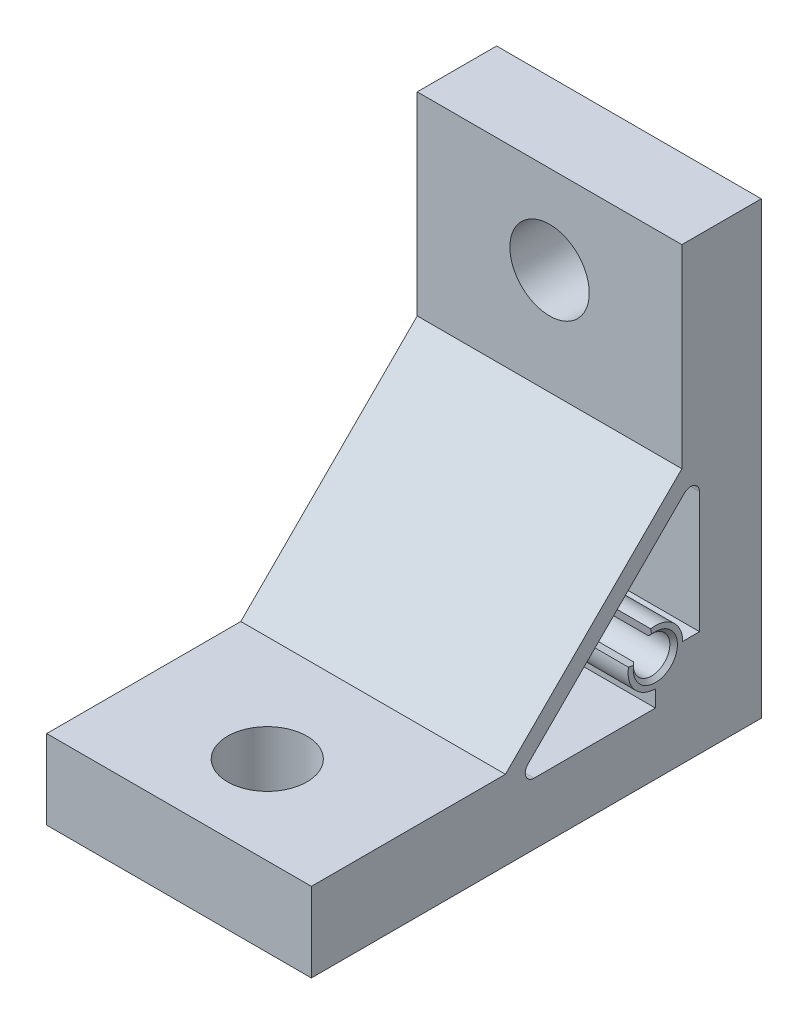
ISO-10303-21;
HEADER;
FILE_DESCRIPTION(('STEP AP214'),'2;1');
FILE_NAME('part.step','',(''),(''),'','','');
FILE_SCHEMA(('AUTOMOTIVE_DESIGN { 1 0 10303 214 1 1 1 1 }'));
ENDSEC;
DATA;
#1=APPLICATION_CONTEXT('core data for automotive mechanical design processes');
#2=APPLICATION_PROTOCOL_DEFINITION('international standard','automotive_design',2000,#1);
#3=PRODUCT_CONTEXT('',#1,'mechanical');
#4=PRODUCT('Part','Part','',(#3));
#5=PRODUCT_RELATED_PRODUCT_CATEGORY('part','',(#4));
#6=PRODUCT_DEFINITION_FORMATION('','',#4);
#7=PRODUCT_DEFINITION_CONTEXT('part definition',#1,'design');
#8=PRODUCT_DEFINITION('design','',#6,#7);
#9=PRODUCT_DEFINITION_SHAPE('','',#8);
#10=(LENGTH_UNIT() NAMED_UNIT(*) SI_UNIT(.MILLI.,.METRE.));
#11=(NAMED_UNIT(*) PLANE_ANGLE_UNIT() SI_UNIT($,.RADIAN.));
#12=(NAMED_UNIT(*) SI_UNIT($,.STERADIAN.) SOLID_ANGLE_UNIT());
#13=UNCERTAINTY_MEASURE_WITH_UNIT(LENGTH_MEASURE(1.E-05),#10,'distance_accuracy_value','');
#14=(GEOMETRIC_REPRESENTATION_CONTEXT(3) GLOBAL_UNCERTAINTY_ASSIGNED_CONTEXT((#13)) GLOBAL_UNIT_ASSIGNED_CONTEXT((#10,
#11,#12)) REPRESENTATION_CONTEXT('',''));
#15=CARTESIAN_POINT('',(0.,0.,0.));
#16=DIRECTION('',(0.,0.,1.));
#17=DIRECTION('',(1.,0.,0.));
#18=AXIS2_PLACEMENT_3D('',#15,#16,#17);
#19=CARTESIAN_POINT('',(15.,12.5842575299601,12.5842575299601));
#20=DIRECTION('',(-1.,0.,0.));
#21=DIRECTION('',(0.,0.,1.));
#22=AXIS2_PLACEMENT_3D('',#19,#20,#21);
#23=CYLINDRICAL_SURFACE('',#22,1.5);
#24=DIRECTION('',(-1.,0.,0.));
#25=VECTOR('',#24,1.);
#26=CARTESIAN_POINT('',(15.,12.3646611731006,14.0680962813256));
#27=LINE('',#26,#25);
#28=CARTESIAN_POINT('',(14.6000000000132,12.3646611731006,14.0680962813256));
#29=VERTEX_POINT('',#28);
#30=CARTESIAN_POINT('',(-15.,12.3646611731006,14.0680962813256));
#31=VERTEX_POINT('',#30);
#32=EDGE_CURVE('E231',#29,#31,#27,.T.);
#33=ORIENTED_EDGE('',*,*,#32,.F.);
#34=CARTESIAN_POINT('',(14.6000000000132,12.3646611731006,14.0680962813256));
#35=CARTESIAN_POINT('',(14.5946552278805,12.3479248156858,14.065617542445));
#36=CARTESIAN_POINT('',(14.5892328408037,12.3312644465256,14.0628636826782));
#37=CARTESIAN_POINT('',(14.5782328406928,12.2980956965681,14.0568057235374));
#38=CARTESIAN_POINT('',(14.5726552277696,12.281587315662,14.0535016245565));
#39=CARTESIAN_POINT('',(14.5670000000132,12.265154922902,14.0499224050829));
#40=B_SPLINE_CURVE_WITH_KNOTS('',3,(#34,#35,#36,#37,#38,#39),.UNSPECIFIED.,.F.,.F.,(4,2,4),(0.,
0.0532070045388904,0.10641397104909),.UNSPECIFIED.);
#41=CARTESIAN_POINT('',(14.5670000000132,12.265154922902,14.0499224050829));
#42=VERTEX_POINT('',#41);
#43=EDGE_CURVE('E11',#29,#42,#40,.T.);
#44=ORIENTED_EDGE('',*,*,#43,.T.);
#45=DIRECTION('',(1.,0.,0.));
#46=VECTOR('',#45,1.);
#47=CARTESIAN_POINT('',(0.,12.265154922902,14.0499224050829));
#48=LINE('',#47,#46);
#49=CARTESIAN_POINT('',(-15.,12.265154922902,14.0499224050829));
#50=VERTEX_POINT('',#49);
#51=EDGE_CURVE('E200',#42,#50,#48,.F.);
#52=ORIENTED_EDGE('',*,*,#51,.T.);
#53=CARTESIAN_POINT('',(-15.,12.5842575299601,12.5842575299601));
#54=DIRECTION('',(-1.,0.,0.));
#55=DIRECTION('',(0.,0.,1.));
#56=AXIS2_PLACEMENT_3D('',#53,#54,#55);
#57=CIRCLE('',#56,1.5);
#58=EDGE_CURVE('E211',#50,#31,#57,.T.);
#59=ORIENTED_EDGE('',*,*,#58,.T.);
#60=EDGE_LOOP('',(#33,#44,#52,#59));
#61=FACE_BOUND('',#60,.T.);
#62=ADVANCED_FACE('F35',(#61),#23,.F.);
#63=CARTESIAN_POINT('',(-15.,0.,0.));
#64=DIRECTION('',(0.,0.,-1.));
#65=DIRECTION('',(-1.,0.,0.));
#66=AXIS2_PLACEMENT_3D('',#63,#64,#65);
#67=PLANE('',#66);
#68=CARTESIAN_POINT('',(0.,41.,0.));
#69=DIRECTION('',(0.,0.,1.));
#70=DIRECTION('',(1.,0.,0.));
#71=AXIS2_PLACEMENT_3D('',#68,#69,#70);
#72=CIRCLE('',#71,4.49999999999999);
#73=CARTESIAN_POINT('',(4.49999999999999,41.,0.));
#74=VERTEX_POINT('',#73);
#75=EDGE_CURVE('E213',#74,#74,#72,.T.);
#76=ORIENTED_EDGE('',*,*,#75,.T.);
#77=EDGE_LOOP('',(#76));
#78=FACE_BOUND('',#77,.T.);
#79=DIRECTION('',(0.,1.,0.));
#80=VECTOR('',#79,1.);
#81=CARTESIAN_POINT('',(15.,0.,0.));
#82=LINE('',#81,#80);
#83=CARTESIAN_POINT('',(15.,0.,0.));
#84=VERTEX_POINT('',#83);
#85=CARTESIAN_POINT('',(15.,51.,0.));
#86=VERTEX_POINT('',#85);
#87=EDGE_CURVE('E274',#84,#86,#82,.T.);
#88=ORIENTED_EDGE('',*,*,#87,.F.);
#89=DIRECTION('',(1.,0.,0.));
#90=VECTOR('',#89,1.);
#91=CARTESIAN_POINT('',(-15.,0.,0.));
#92=LINE('',#91,#90);
#93=CARTESIAN_POINT('',(-15.,0.,0.));
#94=VERTEX_POINT('',#93);
#95=EDGE_CURVE('E201',#94,#84,#92,.T.);
#96=ORIENTED_EDGE('',*,*,#95,.F.);
#97=DIRECTION('',(0.,1.,0.));
#98=VECTOR('',#97,1.);
#99=CARTESIAN_POINT('',(-15.,0.,0.));
#100=LINE('',#99,#98);
#101=CARTESIAN_POINT('',(-15.,51.,0.));
#102=VERTEX_POINT('',#101);
#103=EDGE_CURVE('E280',#94,#102,#100,.T.);
#104=ORIENTED_EDGE('',*,*,#103,.T.);
#105=DIRECTION('',(1.,0.,0.));
#106=VECTOR('',#105,1.);
#107=CARTESIAN_POINT('',(-15.,51.,0.));
#108=LINE('',#107,#106);
#109=EDGE_CURVE('E292',#102,#86,#108,.T.);
#110=ORIENTED_EDGE('',*,*,#109,.T.);
#111=EDGE_LOOP('',(#88,#96,#104,#110));
#112=FACE_BOUND('',#111,.T.);
#113=ADVANCED_FACE('F390',(#78,#112),#67,.T.);
#114=CARTESIAN_POINT('',(-15.,0.,51.));
#115=DIRECTION('',(0.,-1.,0.));
#116=DIRECTION('',(0.,0.,-1.));
#117=AXIS2_PLACEMENT_3D('',#114,#115,#116);
#118=PLANE('',#117);
#119=CARTESIAN_POINT('',(0.,0.,41.));
#120=DIRECTION('',(0.,1.,0.));
#121=DIRECTION('',(0.,0.,1.));
#122=AXIS2_PLACEMENT_3D('',#119,#120,#121);
#123=CIRCLE('',#122,4.49999999999998);
#124=CARTESIAN_POINT('',(0.,0.,45.5));
#125=VERTEX_POINT('',#124);
#126=EDGE_CURVE('E439',#125,#125,#123,.T.);
#127=ORIENTED_EDGE('',*,*,#126,.T.);
#128=EDGE_LOOP('',(#127));
#129=FACE_BOUND('',#128,.T.);
#130=DIRECTION('',(0.,0.,-1.));
#131=VECTOR('',#130,1.);
#132=CARTESIAN_POINT('',(15.,0.,51.));
#133=LINE('',#132,#131);
#134=CARTESIAN_POINT('',(15.,0.,51.));
#135=VERTEX_POINT('',#134);
#136=EDGE_CURVE('E284',#135,#84,#133,.T.);
#137=ORIENTED_EDGE('',*,*,#136,.F.);
#138=DIRECTION('',(1.,0.,0.));
#139=VECTOR('',#138,1.);
#140=CARTESIAN_POINT('',(-15.,0.,51.));
#141=LINE('',#140,#139);
#142=CARTESIAN_POINT('',(-15.,0.,51.));
#143=VERTEX_POINT('',#142);
#144=EDGE_CURVE('E303',#143,#135,#141,.T.);
#145=ORIENTED_EDGE('',*,*,#144,.F.);
#146=DIRECTION('',(0.,0.,-1.));
#147=VECTOR('',#146,1.);
#148=CARTESIAN_POINT('',(-15.,0.,51.));
#149=LINE('',#148,#147);
#150=EDGE_CURVE('E289',#143,#94,#149,.T.);
#151=ORIENTED_EDGE('',*,*,#150,.T.);
#152=ORIENTED_EDGE('',*,*,#95,.T.);
#153=EDGE_LOOP('',(#137,#145,#151,#152));
#154=FACE_BOUND('',#153,.T.);
#155=ADVANCED_FACE('F386',(#129,#154),#118,.T.);
#156=CARTESIAN_POINT('',(-15.,51.,51.));
#157=DIRECTION('',(0.,0.,1.));
#158=DIRECTION('',(1.,0.,0.));
#159=AXIS2_PLACEMENT_3D('',#156,#157,#158);
#160=PLANE('',#159);
#161=DIRECTION('',(-1.,0.,0.));
#162=VECTOR('',#161,1.);
#163=CARTESIAN_POINT('',(15.,9.,51.));
#164=LINE('',#163,#162);
#165=CARTESIAN_POINT('',(15.,9.,51.));
#166=VERTEX_POINT('',#165);
#167=CARTESIAN_POINT('',(-15.,9.,51.));
#168=VERTEX_POINT('',#167);
#169=EDGE_CURVE('E271',#166,#168,#164,.T.);
#170=ORIENTED_EDGE('',*,*,#169,.T.);
#171=DIRECTION('',(0.,-1.,0.));
#172=VECTOR('',#171,1.);
#173=CARTESIAN_POINT('',(-15.,51.,51.));
#174=LINE('',#173,#172);
#175=EDGE_CURVE('E287',#168,#143,#174,.T.);
#176=ORIENTED_EDGE('',*,*,#175,.T.);
#177=ORIENTED_EDGE('',*,*,#144,.T.);
#178=DIRECTION('',(0.,-1.,0.));
#179=VECTOR('',#178,1.);
#180=CARTESIAN_POINT('',(15.,51.,51.));
#181=LINE('',#180,#179);
#182=EDGE_CURVE('E298',#166,#135,#181,.T.);
#183=ORIENTED_EDGE('',*,*,#182,.F.);
#184=EDGE_LOOP('',(#170,#176,#177,#183));
#185=FACE_BOUND('',#184,.T.);
#186=ADVANCED_FACE('F389',(#185),#160,.T.);
#187=CARTESIAN_POINT('',(-15.,51.,0.));
#188=DIRECTION('',(0.,1.,0.));
#189=DIRECTION('',(0.,0.,1.));
#190=AXIS2_PLACEMENT_3D('',#187,#188,#189);
#191=PLANE('',#190);
#192=DIRECTION('',(-1.,0.,0.));
#193=VECTOR('',#192,1.);
#194=CARTESIAN_POINT('',(15.,51.,9.));
#195=LINE('',#194,#193);
#196=CARTESIAN_POINT('',(15.,51.,9.));
#197=VERTEX_POINT('',#196);
#198=CARTESIAN_POINT('',(-15.,51.,9.));
#199=VERTEX_POINT('',#198);
#200=EDGE_CURVE('E264',#197,#199,#195,.T.);
#201=ORIENTED_EDGE('',*,*,#200,.F.);
#202=DIRECTION('',(0.,0.,1.));
#203=VECTOR('',#202,1.);
#204=CARTESIAN_POINT('',(15.,51.,0.));
#205=LINE('',#204,#203);
#206=EDGE_CURVE('E295',#86,#197,#205,.T.);
#207=ORIENTED_EDGE('',*,*,#206,.F.);
#208=ORIENTED_EDGE('',*,*,#109,.F.);
#209=DIRECTION('',(0.,0.,1.));
#210=VECTOR('',#209,1.);
#211=CARTESIAN_POINT('',(-15.,51.,0.));
#212=LINE('',#211,#210);
#213=EDGE_CURVE('E283',#102,#199,#212,.T.);
#214=ORIENTED_EDGE('',*,*,#213,.T.);
#215=EDGE_LOOP('',(#201,#207,#208,#214));
#216=FACE_BOUND('',#215,.T.);
#217=ADVANCED_FACE('F382',(#216),#191,.T.);
#218=CARTESIAN_POINT('',(-15.,0.,0.));
#219=DIRECTION('',(1.,0.,0.));
#220=DIRECTION('',(0.,0.,-1.));
#221=AXIS2_PLACEMENT_3D('',#218,#219,#220);
#222=PLANE('',#221);
#223=ORIENTED_EDGE('',*,*,#58,.F.);
#224=CARTESIAN_POINT('',(-15.,12.,12.));
#225=DIRECTION('',(1.,0.,0.));
#226=DIRECTION('',(0.,0.,-1.));
#227=AXIS2_PLACEMENT_3D('',#224,#225,#226);
#228=CIRCLE('',#227,2.067);
#229=CARTESIAN_POINT('',(-15.,14.0499224050829,12.265154922902));
#230=VERTEX_POINT('',#229);
#231=EDGE_CURVE('E193',#50,#230,#228,.T.);
#232=ORIENTED_EDGE('',*,*,#231,.T.);
#233=CARTESIAN_POINT('',(-15.,14.0680962813256,12.3646611731006));
#234=VERTEX_POINT('',#233);
#235=EDGE_CURVE('E208',#234,#230,#57,.T.);
#236=ORIENTED_EDGE('',*,*,#235,.F.);
#237=DIRECTION('',(0.,-0.98480775301221,-0.173648177666919));
#238=VECTOR('',#237,1.);
#239=CARTESIAN_POINT('',(-15.,15.0529040343378,12.5383093507675));
#240=LINE('',#239,#238);
#241=CARTESIAN_POINT('',(-15.,15.0529040343378,12.5383093507675));
#242=VERTEX_POINT('',#241);
#243=EDGE_CURVE('E224',#242,#234,#240,.T.);
#244=ORIENTED_EDGE('',*,*,#243,.F.);
#245=CARTESIAN_POINT('',(-15.,12.,12.));
#246=DIRECTION('',(1.,0.,0.));
#247=DIRECTION('',(0.,0.,-1.));
#248=AXIS2_PLACEMENT_3D('',#245,#246,#247);
#249=CIRCLE('',#248,3.1);
#250=CARTESIAN_POINT('',(-15.,12.,8.9));
#251=VERTEX_POINT('',#250);
#252=EDGE_CURVE('E498',#251,#242,#249,.T.);
#253=ORIENTED_EDGE('',*,*,#252,.F.);
#254=DIRECTION('',(0.,0.,1.));
#255=VECTOR('',#254,1.);
#256=CARTESIAN_POINT('',(-15.,12.,7.));
#257=LINE('',#256,#255);
#258=CARTESIAN_POINT('',(-15.,12.,7.));
#259=VERTEX_POINT('',#258);
#260=EDGE_CURVE('E496',#259,#251,#257,.T.);
#261=ORIENTED_EDGE('',*,*,#260,.F.);
#262=DIRECTION('',(0.,-1.,0.));
#263=VECTOR('',#262,1.);
#264=CARTESIAN_POINT('',(-15.,25.7573593128807,7.));
#265=LINE('',#264,#263);
#266=CARTESIAN_POINT('',(-15.,25.7573593128807,7.));
#267=VERTEX_POINT('',#266);
#268=EDGE_CURVE('E493',#267,#259,#265,.T.);
#269=ORIENTED_EDGE('',*,*,#268,.F.);
#270=CARTESIAN_POINT('',(-15.,25.7573593128807,8.));
#271=DIRECTION('',(-1.,0.,0.));
#272=DIRECTION('',(0.,0.,1.));
#273=AXIS2_PLACEMENT_3D('',#270,#271,#272);
#274=CIRCLE('',#273,1.00000000000001);
#275=CARTESIAN_POINT('',(-15.,26.4644660940673,8.70710678118654));
#276=VERTEX_POINT('',#275);
#277=EDGE_CURVE('E490',#276,#267,#274,.T.);
#278=ORIENTED_EDGE('',*,*,#277,.F.);
#279=DIRECTION('',(0.,0.707106781186547,-0.707106781186548));
#280=VECTOR('',#279,1.);
#281=CARTESIAN_POINT('',(-15.,8.70710678118656,26.4644660940673));
#282=LINE('',#281,#280);
#283=CARTESIAN_POINT('',(-15.,8.70710678118656,26.4644660940673));
#284=VERTEX_POINT('',#283);
#285=EDGE_CURVE('E487',#284,#276,#282,.T.);
#286=ORIENTED_EDGE('',*,*,#285,.F.);
#287=CARTESIAN_POINT('',(-15.,8.,25.7573593128807));
#288=DIRECTION('',(-1.,0.,0.));
#289=DIRECTION('',(0.,0.,1.));
#290=AXIS2_PLACEMENT_3D('',#287,#288,#289);
#291=CIRCLE('',#290,1.00000000000002);
#292=CARTESIAN_POINT('',(-15.,6.99999999999998,25.7573593128807));
#293=VERTEX_POINT('',#292);
#294=EDGE_CURVE('E484',#293,#284,#291,.T.);
#295=ORIENTED_EDGE('',*,*,#294,.F.);
#296=DIRECTION('',(0.,0.,1.));
#297=VECTOR('',#296,1.);
#298=CARTESIAN_POINT('',(-15.,7.,12.));
#299=LINE('',#298,#297);
#300=CARTESIAN_POINT('',(-15.,7.,12.));
#301=VERTEX_POINT('',#300);
#302=EDGE_CURVE('E481',#301,#293,#299,.T.);
#303=ORIENTED_EDGE('',*,*,#302,.F.);
#304=DIRECTION('',(0.,-1.,0.));
#305=VECTOR('',#304,1.);
#306=CARTESIAN_POINT('',(-15.,8.9,12.));
#307=LINE('',#306,#305);
#308=CARTESIAN_POINT('',(-15.,8.9,12.));
#309=VERTEX_POINT('',#308);
#310=EDGE_CURVE('E478',#309,#301,#307,.T.);
#311=ORIENTED_EDGE('',*,*,#310,.F.);
#312=CARTESIAN_POINT('',(-15.,12.,12.));
#313=DIRECTION('',(1.,0.,0.));
#314=DIRECTION('',(0.,0.,-1.));
#315=AXIS2_PLACEMENT_3D('',#312,#313,#314);
#316=CIRCLE('',#315,3.1);
#317=CARTESIAN_POINT('',(-15.,12.5383093507675,15.0529040343378));
#318=VERTEX_POINT('',#317);
#319=EDGE_CURVE('E212',#318,#309,#316,.T.);
#320=ORIENTED_EDGE('',*,*,#319,.F.);
#321=DIRECTION('',(0.,0.173648177666932,0.984807753012208));
#322=VECTOR('',#321,1.);
#323=CARTESIAN_POINT('',(-15.,12.3646611731006,14.0680962813256));
#324=LINE('',#323,#322);
#325=EDGE_CURVE('E219',#31,#318,#324,.T.);
#326=ORIENTED_EDGE('',*,*,#325,.F.);
#327=EDGE_LOOP('',(#223,#232,#236,#244,#253,#261,#269,#278,#286,#295,#303,#311,#320,#326));
#328=FACE_BOUND('',#327,.T.);
#329=ORIENTED_EDGE('',*,*,#175,.F.);
#330=DIRECTION('',(0.,0.,1.));
#331=VECTOR('',#330,1.);
#332=CARTESIAN_POINT('',(-15.,9.,29.));
#333=LINE('',#332,#331);
#334=CARTESIAN_POINT('',(-15.,9.,29.));
#335=VERTEX_POINT('',#334);
#336=EDGE_CURVE('E258',#335,#168,#333,.T.);
#337=ORIENTED_EDGE('',*,*,#336,.F.);
#338=DIRECTION('',(0.,-0.707106781186547,0.707106781186548));
#339=VECTOR('',#338,1.);
#340=CARTESIAN_POINT('',(-15.,29.,9.));
#341=LINE('',#340,#339);
#342=CARTESIAN_POINT('',(-15.,29.,9.));
#343=VERTEX_POINT('',#342);
#344=EDGE_CURVE('E267',#343,#335,#341,.T.);
#345=ORIENTED_EDGE('',*,*,#344,.F.);
#346=DIRECTION('',(0.,-1.,0.));
#347=VECTOR('',#346,1.);
#348=CARTESIAN_POINT('',(-15.,51.,9.));
#349=LINE('',#348,#347);
#350=EDGE_CURVE('E230',#199,#343,#349,.T.);
#351=ORIENTED_EDGE('',*,*,#350,.F.);
#352=ORIENTED_EDGE('',*,*,#213,.F.);
#353=ORIENTED_EDGE('',*,*,#103,.F.);
#354=ORIENTED_EDGE('',*,*,#150,.F.);
#355=EDGE_LOOP('',(#329,#337,#345,#351,#352,#353,#354));
#356=FACE_BOUND('',#355,.T.);
#357=ADVANCED_FACE('F205',(#328,#356),#222,.F.);
#358=CARTESIAN_POINT('',(15.,0.,0.));
#359=DIRECTION('',(1.,0.,0.));
#360=DIRECTION('',(0.,0.,-1.));
#361=AXIS2_PLACEMENT_3D('',#358,#359,#360);
#362=PLANE('',#361);
#363=DIRECTION('',(0.,-0.98480775301221,-0.173648177666919));
#364=VECTOR('',#363,1.);
#365=CARTESIAN_POINT('',(15.,15.0529040343378,12.5383093507675));
#366=LINE('',#365,#364);
#367=CARTESIAN_POINT('',(15.,15.0529040343378,12.5383093507675));
#368=VERTEX_POINT('',#367);
#369=CARTESIAN_POINT('',(15.,14.5120855163498,12.4429484543795));
#370=VERTEX_POINT('',#369);
#371=EDGE_CURVE('E473',#368,#370,#366,.T.);
#372=ORIENTED_EDGE('',*,*,#371,.T.);
#373=CARTESIAN_POINT('',(15.,12.5842575299601,12.5842575299601));
#374=DIRECTION('',(1.,0.,0.));
#375=DIRECTION('',(0.,0.,-1.));
#376=AXIS2_PLACEMENT_3D('',#373,#374,#375);
#377=CIRCLE('',#376,1.93299999998681);
#378=CARTESIAN_POINT('',(15.,14.4877109599947,12.2475766133066));
#379=VERTEX_POINT('',#378);
#380=EDGE_CURVE('E310',#370,#379,#377,.F.);
#381=ORIENTED_EDGE('',*,*,#380,.T.);
#382=CARTESIAN_POINT('',(15.,12.,12.));
#383=DIRECTION('',(1.,0.,0.));
#384=DIRECTION('',(0.,0.,-1.));
#385=AXIS2_PLACEMENT_3D('',#382,#383,#384);
#386=CIRCLE('',#385,2.49999999998681);
#387=CARTESIAN_POINT('',(15.,12.4341204441651,14.4620193825175));
#388=VERTEX_POINT('',#387);
#389=EDGE_CURVE('E308',#379,#388,#386,.F.);
#390=ORIENTED_EDGE('',*,*,#389,.T.);
#391=DIRECTION('',(0.,0.173648177666932,0.984807753012208));
#392=VECTOR('',#391,1.);
#393=CARTESIAN_POINT('',(15.,12.3646611731006,14.0680962813256));
#394=LINE('',#393,#392);
#395=CARTESIAN_POINT('',(15.,12.5383093507675,15.0529040343378));
#396=VERTEX_POINT('',#395);
#397=EDGE_CURVE('E253',#388,#396,#394,.T.);
#398=ORIENTED_EDGE('',*,*,#397,.T.);
#399=CARTESIAN_POINT('',(15.,12.,12.));
#400=DIRECTION('',(1.,0.,0.));
#401=DIRECTION('',(0.,0.,-1.));
#402=AXIS2_PLACEMENT_3D('',#399,#400,#401);
#403=CIRCLE('',#402,3.1);
#404=CARTESIAN_POINT('',(15.,8.9,12.));
#405=VERTEX_POINT('',#404);
#406=EDGE_CURVE('E222',#396,#405,#403,.T.);
#407=ORIENTED_EDGE('',*,*,#406,.T.);
#408=DIRECTION('',(0.,-1.,0.));
#409=VECTOR('',#408,1.);
#410=CARTESIAN_POINT('',(15.,8.9,12.));
#411=LINE('',#410,#409);
#412=CARTESIAN_POINT('',(15.,7.,12.));
#413=VERTEX_POINT('',#412);
#414=EDGE_CURVE('E449',#405,#413,#411,.T.);
#415=ORIENTED_EDGE('',*,*,#414,.T.);
#416=DIRECTION('',(0.,0.,1.));
#417=VECTOR('',#416,1.);
#418=CARTESIAN_POINT('',(15.,7.,12.));
#419=LINE('',#418,#417);
#420=CARTESIAN_POINT('',(15.,6.99999999999998,25.7573593128807));
#421=VERTEX_POINT('',#420);
#422=EDGE_CURVE('E452',#413,#421,#419,.T.);
#423=ORIENTED_EDGE('',*,*,#422,.T.);
#424=CARTESIAN_POINT('',(15.,8.,25.7573593128807));
#425=DIRECTION('',(-1.,0.,0.));
#426=DIRECTION('',(0.,0.,1.));
#427=AXIS2_PLACEMENT_3D('',#424,#425,#426);
#428=CIRCLE('',#427,1.00000000000002);
#429=CARTESIAN_POINT('',(15.,8.70710678118656,26.4644660940673));
#430=VERTEX_POINT('',#429);
#431=EDGE_CURVE('E455',#421,#430,#428,.T.);
#432=ORIENTED_EDGE('',*,*,#431,.T.);
#433=DIRECTION('',(0.,0.707106781186547,-0.707106781186548));
#434=VECTOR('',#433,1.);
#435=CARTESIAN_POINT('',(15.,8.70710678118656,26.4644660940673));
#436=LINE('',#435,#434);
#437=CARTESIAN_POINT('',(15.,26.4644660940673,8.70710678118654));
#438=VERTEX_POINT('',#437);
#439=EDGE_CURVE('E458',#430,#438,#436,.T.);
#440=ORIENTED_EDGE('',*,*,#439,.T.);
#441=CARTESIAN_POINT('',(15.,25.7573593128807,8.));
#442=DIRECTION('',(-1.,0.,0.));
#443=DIRECTION('',(0.,0.,1.));
#444=AXIS2_PLACEMENT_3D('',#441,#442,#443);
#445=CIRCLE('',#444,1.00000000000001);
#446=CARTESIAN_POINT('',(15.,25.7573593128807,7.));
#447=VERTEX_POINT('',#446);
#448=EDGE_CURVE('E461',#438,#447,#445,.T.);
#449=ORIENTED_EDGE('',*,*,#448,.T.);
#450=DIRECTION('',(0.,-1.,0.));
#451=VECTOR('',#450,1.);
#452=CARTESIAN_POINT('',(15.,25.7573593128807,7.));
#453=LINE('',#452,#451);
#454=CARTESIAN_POINT('',(15.,12.,7.));
#455=VERTEX_POINT('',#454);
#456=EDGE_CURVE('E464',#447,#455,#453,.T.);
#457=ORIENTED_EDGE('',*,*,#456,.T.);
#458=DIRECTION('',(0.,0.,1.));
#459=VECTOR('',#458,1.);
#460=CARTESIAN_POINT('',(15.,12.,7.));
#461=LINE('',#460,#459);
#462=CARTESIAN_POINT('',(15.,12.,8.9));
#463=VERTEX_POINT('',#462);
#464=EDGE_CURVE('E467',#455,#463,#461,.T.);
#465=ORIENTED_EDGE('',*,*,#464,.T.);
#466=CARTESIAN_POINT('',(15.,12.,12.));
#467=DIRECTION('',(1.,0.,0.));
#468=DIRECTION('',(0.,0.,-1.));
#469=AXIS2_PLACEMENT_3D('',#466,#467,#468);
#470=CIRCLE('',#469,3.1);
#471=EDGE_CURVE('E470',#463,#368,#470,.T.);
#472=ORIENTED_EDGE('',*,*,#471,.T.);
#473=EDGE_LOOP('',(#372,#381,#390,#398,#407,#415,#423,#432,#440,#449,#457,#465,#472));
#474=FACE_BOUND('',#473,.T.);
#475=DIRECTION('',(0.,0.,1.));
#476=VECTOR('',#475,1.);
#477=CARTESIAN_POINT('',(15.,9.,29.));
#478=LINE('',#477,#476);
#479=CARTESIAN_POINT('',(15.,9.,29.));
#480=VERTEX_POINT('',#479);
#481=EDGE_CURVE('E261',#480,#166,#478,.T.);
#482=ORIENTED_EDGE('',*,*,#481,.T.);
#483=ORIENTED_EDGE('',*,*,#182,.T.);
#484=ORIENTED_EDGE('',*,*,#136,.T.);
#485=ORIENTED_EDGE('',*,*,#87,.T.);
#486=ORIENTED_EDGE('',*,*,#206,.T.);
#487=DIRECTION('',(0.,-1.,0.));
#488=VECTOR('',#487,1.);
#489=CARTESIAN_POINT('',(15.,51.,9.));
#490=LINE('',#489,#488);
#491=CARTESIAN_POINT('',(15.,29.,9.));
#492=VERTEX_POINT('',#491);
#493=EDGE_CURVE('E254',#197,#492,#490,.T.);
#494=ORIENTED_EDGE('',*,*,#493,.T.);
#495=DIRECTION('',(0.,-0.707106781186547,0.707106781186548));
#496=VECTOR('',#495,1.);
#497=CARTESIAN_POINT('',(15.,29.,9.));
#498=LINE('',#497,#496);
#499=EDGE_CURVE('E257',#492,#480,#498,.T.);
#500=ORIENTED_EDGE('',*,*,#499,.T.);
#501=EDGE_LOOP('',(#482,#483,#484,#485,#486,#494,#500));
#502=FACE_BOUND('',#501,.T.);
#503=ADVANCED_FACE('F372',(#474,#502),#362,.T.);
#504=CARTESIAN_POINT('',(15.,9.,29.));
#505=DIRECTION('',(0.,-1.,0.));
#506=DIRECTION('',(0.,0.,-1.));
#507=AXIS2_PLACEMENT_3D('',#504,#505,#506);
#508=PLANE('',#507);
#509=CARTESIAN_POINT('',(0.,9.,41.));
#510=DIRECTION('',(0.,1.,0.));
#511=DIRECTION('',(0.,0.,1.));
#512=AXIS2_PLACEMENT_3D('',#509,#510,#511);
#513=CIRCLE('',#512,4.49999999999998);
#514=CARTESIAN_POINT('',(0.,9.,45.5));
#515=VERTEX_POINT('',#514);
#516=EDGE_CURVE('E443',#515,#515,#513,.T.);
#517=ORIENTED_EDGE('',*,*,#516,.F.);
#518=EDGE_LOOP('',(#517));
#519=FACE_BOUND('',#518,.T.);
#520=ORIENTED_EDGE('',*,*,#336,.T.);
#521=ORIENTED_EDGE('',*,*,#169,.F.);
#522=ORIENTED_EDGE('',*,*,#481,.F.);
#523=DIRECTION('',(-1.,0.,0.));
#524=VECTOR('',#523,1.);
#525=CARTESIAN_POINT('',(15.,9.,29.));
#526=LINE('',#525,#524);
#527=EDGE_CURVE('E275',#480,#335,#526,.T.);
#528=ORIENTED_EDGE('',*,*,#527,.T.);
#529=EDGE_LOOP('',(#520,#521,#522,#528));
#530=FACE_BOUND('',#529,.T.);
#531=ADVANCED_FACE('F368',(#519,#530),#508,.F.);
#532=CARTESIAN_POINT('',(15.,29.,9.));
#533=DIRECTION('',(0.,-0.707106781186547,-0.707106781186547));
#534=DIRECTION('',(0.,0.707106781186547,-0.707106781186548));
#535=AXIS2_PLACEMENT_3D('',#532,#533,#534);
#536=PLANE('',#535);
#537=ORIENTED_EDGE('',*,*,#344,.T.);
#538=ORIENTED_EDGE('',*,*,#527,.F.);
#539=ORIENTED_EDGE('',*,*,#499,.F.);
#540=DIRECTION('',(-1.,0.,0.));
#541=VECTOR('',#540,1.);
#542=CARTESIAN_POINT('',(15.,29.,9.));
#543=LINE('',#542,#541);
#544=EDGE_CURVE('E277',#492,#343,#543,.T.);
#545=ORIENTED_EDGE('',*,*,#544,.T.);
#546=EDGE_LOOP('',(#537,#538,#539,#545));
#547=FACE_BOUND('',#546,.T.);
#548=ADVANCED_FACE('F371',(#547),#536,.F.);
#549=CARTESIAN_POINT('',(15.,51.,9.));
#550=DIRECTION('',(0.,0.,-1.));
#551=DIRECTION('',(-1.,0.,0.));
#552=AXIS2_PLACEMENT_3D('',#549,#550,#551);
#553=PLANE('',#552);
#554=CARTESIAN_POINT('',(0.,41.,9.));
#555=DIRECTION('',(0.,0.,1.));
#556=DIRECTION('',(1.,0.,0.));
#557=AXIS2_PLACEMENT_3D('',#554,#555,#556);
#558=CIRCLE('',#557,4.49999999999999);
#559=CARTESIAN_POINT('',(4.49999999999999,41.,9.));
#560=VERTEX_POINT('',#559);
#561=EDGE_CURVE('E438',#560,#560,#558,.T.);
#562=ORIENTED_EDGE('',*,*,#561,.F.);
#563=EDGE_LOOP('',(#562));
#564=FACE_BOUND('',#563,.T.);
#565=ORIENTED_EDGE('',*,*,#350,.T.);
#566=ORIENTED_EDGE('',*,*,#544,.F.);
#567=ORIENTED_EDGE('',*,*,#493,.F.);
#568=ORIENTED_EDGE('',*,*,#200,.T.);
#569=EDGE_LOOP('',(#565,#566,#567,#568));
#570=FACE_BOUND('',#569,.T.);
#571=ADVANCED_FACE('F366',(#564,#570),#553,.F.);
#572=CARTESIAN_POINT('',(15.,12.,12.));
#573=DIRECTION('',(-1.,0.,0.));
#574=DIRECTION('',(0.,0.,1.));
#575=AXIS2_PLACEMENT_3D('',#572,#573,#574);
#576=CYLINDRICAL_SURFACE('',#575,3.1);
#577=ORIENTED_EDGE('',*,*,#319,.T.);
#578=DIRECTION('',(-1.,0.,0.));
#579=VECTOR('',#578,1.);
#580=CARTESIAN_POINT('',(15.,8.9,12.));
#581=LINE('',#580,#579);
#582=EDGE_CURVE('E250',#405,#309,#581,.T.);
#583=ORIENTED_EDGE('',*,*,#582,.F.);
#584=ORIENTED_EDGE('',*,*,#406,.F.);
#585=DIRECTION('',(-1.,0.,0.));
#586=VECTOR('',#585,1.);
#587=CARTESIAN_POINT('',(15.,12.5383093507675,15.0529040343378));
#588=LINE('',#587,#586);
#589=EDGE_CURVE('E228',#396,#318,#588,.T.);
#590=ORIENTED_EDGE('',*,*,#589,.T.);
#591=EDGE_LOOP('',(#577,#583,#584,#590));
#592=FACE_BOUND('',#591,.T.);
#593=ADVANCED_FACE('F362',(#592),#576,.T.);
#594=CARTESIAN_POINT('',(15.,12.3646611731006,14.0680962813256));
#595=DIRECTION('',(0.,-0.984807753012208,0.173648177666931));
#596=DIRECTION('',(0.,-0.173648177666932,-0.984807753012208));
#597=AXIS2_PLACEMENT_3D('',#594,#595,#596);
#598=PLANE('',#597);
#599=ORIENTED_EDGE('',*,*,#397,.F.);
#600=DIRECTION('',(-0.707106781186551,-0.122787803968973,-0.696364240320015));
#601=VECTOR('',#600,1.);
#602=CARTESIAN_POINT('',(12.5000000000132,12.,12.));
#603=LINE('',#602,#601);
#604=EDGE_CURVE('E48',#388,#29,#603,.T.);
#605=ORIENTED_EDGE('',*,*,#604,.T.);
#606=ORIENTED_EDGE('',*,*,#32,.T.);
#607=ORIENTED_EDGE('',*,*,#325,.T.);
#608=ORIENTED_EDGE('',*,*,#589,.F.);
#609=EDGE_LOOP('',(#599,#605,#606,#607,#608));
#610=FACE_BOUND('',#609,.T.);
#611=ADVANCED_FACE('F365',(#610),#598,.F.);
#612=DIRECTION('',(1.,0.,0.));
#613=VECTOR('',#612,1.);
#614=CARTESIAN_POINT('',(0.,14.0499224050829,12.265154922902));
#615=LINE('',#614,#613);
#616=CARTESIAN_POINT('',(14.5670000000132,14.0499224050829,12.265154922902));
#617=VERTEX_POINT('',#616);
#618=EDGE_CURVE('E190',#230,#617,#615,.T.);
#619=ORIENTED_EDGE('',*,*,#618,.T.);
#620=CARTESIAN_POINT('',(14.5670000000132,12.5842575299601,12.5842575299601));
#621=DIRECTION('',(1.,0.,0.));
#622=DIRECTION('',(0.,0.,-1.));
#623=AXIS2_PLACEMENT_3D('',#620,#621,#622);
#624=CIRCLE('',#623,1.5);
#625=CARTESIAN_POINT('',(14.5670000000132,14.0680962813256,12.3646611731006));
#626=VERTEX_POINT('',#625);
#627=EDGE_CURVE('E313',#617,#626,#624,.T.);
#628=ORIENTED_EDGE('',*,*,#627,.T.);
#629=DIRECTION('',(-1.,0.,0.));
#630=VECTOR('',#629,1.);
#631=CARTESIAN_POINT('',(15.,14.0680962813256,12.3646611731006));
#632=LINE('',#631,#630);
#633=EDGE_CURVE('E217',#626,#234,#632,.T.);
#634=ORIENTED_EDGE('',*,*,#633,.T.);
#635=ORIENTED_EDGE('',*,*,#235,.T.);
#636=EDGE_LOOP('',(#619,#628,#634,#635));
#637=FACE_BOUND('',#636,.T.);
#638=ADVANCED_FACE('F215',(#637),#23,.F.);
#639=CARTESIAN_POINT('',(15.,15.0529040343378,12.5383093507675));
#640=DIRECTION('',(0.,0.173648177666919,-0.98480775301221));
#641=DIRECTION('',(0.,0.98480775301221,0.173648177666919));
#642=AXIS2_PLACEMENT_3D('',#639,#640,#641);
#643=PLANE('',#642);
#644=ORIENTED_EDGE('',*,*,#633,.F.);
#645=CARTESIAN_POINT('',(14.5670000000132,14.0680962813256,12.3646611731006));
#646=CARTESIAN_POINT('',(14.6028551667967,14.105310661758,12.3712230724412));
#647=CARTESIAN_POINT('',(14.6387826984651,14.1424572621572,12.3777730203332));
#648=CARTESIAN_POINT('',(14.7107583214008,14.2166365334203,12.3908528272661));
#649=CARTESIAN_POINT('',(14.7468064118124,14.2536692050892,12.3973826864491));
#650=CARTESIAN_POINT('',(14.8189994017932,14.3276426849167,12.4104262067996));
#651=CARTESIAN_POINT('',(14.8551443011241,14.364583493301,12.4169398680069));
#652=CARTESIAN_POINT('',(14.9275153007712,14.4383884013692,12.429953664608));
#653=CARTESIAN_POINT('',(14.9637414016585,14.4752525005102,12.4364537999061));
#654=CARTESIAN_POINT('',(15.,14.5120855163498,12.4429484543795));
#655=B_SPLINE_CURVE_WITH_KNOTS('',3,(#645,#646,#647,#648,#649,#650,#651,#652,#653,#654),
.UNSPECIFIED.,.F.,.F.,(4,2,2,2,4),(0.,0.156275307312189,0.312549507890734,0.468823324039459,
0.625098242297727),.UNSPECIFIED.);
#656=EDGE_CURVE('E315',#626,#370,#655,.T.);
#657=ORIENTED_EDGE('',*,*,#656,.T.);
#658=ORIENTED_EDGE('',*,*,#371,.F.);
#659=DIRECTION('',(-1.,0.,0.));
#660=VECTOR('',#659,1.);
#661=CARTESIAN_POINT('',(15.,15.0529040343378,12.5383093507675));
#662=LINE('',#661,#660);
#663=EDGE_CURVE('E234',#368,#242,#662,.T.);
#664=ORIENTED_EDGE('',*,*,#663,.T.);
#665=ORIENTED_EDGE('',*,*,#243,.T.);
#666=EDGE_LOOP('',(#644,#657,#658,#664,#665));
#667=FACE_BOUND('',#666,.T.);
#668=ADVANCED_FACE('F322',(#667),#643,.F.);
#669=CARTESIAN_POINT('',(15.,12.,12.));
#670=DIRECTION('',(-1.,0.,0.));
#671=DIRECTION('',(0.,0.,1.));
#672=AXIS2_PLACEMENT_3D('',#669,#670,#671);
#673=CYLINDRICAL_SURFACE('',#672,3.1);
#674=ORIENTED_EDGE('',*,*,#252,.T.);
#675=ORIENTED_EDGE('',*,*,#663,.F.);
#676=ORIENTED_EDGE('',*,*,#471,.F.);
#677=DIRECTION('',(-1.,0.,0.));
#678=VECTOR('',#677,1.);
#679=CARTESIAN_POINT('',(15.,12.,8.9));
#680=LINE('',#679,#678);
#681=EDGE_CURVE('E236',#463,#251,#680,.T.);
#682=ORIENTED_EDGE('',*,*,#681,.T.);
#683=EDGE_LOOP('',(#674,#675,#676,#682));
#684=FACE_BOUND('',#683,.T.);
#685=ADVANCED_FACE('F327',(#684),#673,.T.);
#686=CARTESIAN_POINT('',(15.,12.,7.));
#687=DIRECTION('',(0.,-1.,0.));
#688=DIRECTION('',(0.,0.,-1.));
#689=AXIS2_PLACEMENT_3D('',#686,#687,#688);
#690=PLANE('',#689);
#691=ORIENTED_EDGE('',*,*,#260,.T.);
#692=ORIENTED_EDGE('',*,*,#681,.F.);
#693=ORIENTED_EDGE('',*,*,#464,.F.);
#694=DIRECTION('',(-1.,0.,0.));
#695=VECTOR('',#694,1.);
#696=CARTESIAN_POINT('',(15.,12.,7.));
#697=LINE('',#696,#695);
#698=EDGE_CURVE('E238',#455,#259,#697,.T.);
#699=ORIENTED_EDGE('',*,*,#698,.T.);
#700=EDGE_LOOP('',(#691,#692,#693,#699));
#701=FACE_BOUND('',#700,.T.);
#702=ADVANCED_FACE('F333',(#701),#690,.F.);
#703=CARTESIAN_POINT('',(15.,25.7573593128807,7.));
#704=DIRECTION('',(0.,0.,-1.));
#705=DIRECTION('',(-1.,0.,0.));
#706=AXIS2_PLACEMENT_3D('',#703,#704,#705);
#707=PLANE('',#706);
#708=ORIENTED_EDGE('',*,*,#268,.T.);
#709=ORIENTED_EDGE('',*,*,#698,.F.);
#710=ORIENTED_EDGE('',*,*,#456,.F.);
#711=DIRECTION('',(-1.,0.,0.));
#712=VECTOR('',#711,1.);
#713=CARTESIAN_POINT('',(15.,25.7573593128807,7.));
#714=LINE('',#713,#712);
#715=EDGE_CURVE('E240',#447,#267,#714,.T.);
#716=ORIENTED_EDGE('',*,*,#715,.T.);
#717=EDGE_LOOP('',(#708,#709,#710,#716));
#718=FACE_BOUND('',#717,.T.);
#719=ADVANCED_FACE('F337',(#718),#707,.F.);
#720=CARTESIAN_POINT('',(15.,25.7573593128807,8.));
#721=DIRECTION('',(-1.,0.,0.));
#722=DIRECTION('',(0.,0.,1.));
#723=AXIS2_PLACEMENT_3D('',#720,#721,#722);
#724=CYLINDRICAL_SURFACE('',#723,1.00000000000001);
#725=ORIENTED_EDGE('',*,*,#277,.T.);
#726=ORIENTED_EDGE('',*,*,#715,.F.);
#727=ORIENTED_EDGE('',*,*,#448,.F.);
#728=DIRECTION('',(-1.,0.,0.));
#729=VECTOR('',#728,1.);
#730=CARTESIAN_POINT('',(15.,26.4644660940673,8.70710678118654));
#731=LINE('',#730,#729);
#732=EDGE_CURVE('E242',#438,#276,#731,.T.);
#733=ORIENTED_EDGE('',*,*,#732,.T.);
#734=EDGE_LOOP('',(#725,#726,#727,#733));
#735=FACE_BOUND('',#734,.T.);
#736=ADVANCED_FACE('F341',(#735),#724,.F.);
#737=CARTESIAN_POINT('',(15.,8.70710678118656,26.4644660940673));
#738=DIRECTION('',(0.,0.707106781186548,0.707106781186547));
#739=DIRECTION('',(0.,-0.707106781186547,0.707106781186548));
#740=AXIS2_PLACEMENT_3D('',#737,#738,#739);
#741=PLANE('',#740);
#742=ORIENTED_EDGE('',*,*,#285,.T.);
#743=ORIENTED_EDGE('',*,*,#732,.F.);
#744=ORIENTED_EDGE('',*,*,#439,.F.);
#745=DIRECTION('',(-1.,0.,0.));
#746=VECTOR('',#745,1.);
#747=CARTESIAN_POINT('',(15.,8.70710678118656,26.4644660940673));
#748=LINE('',#747,#746);
#749=EDGE_CURVE('E244',#430,#284,#748,.T.);
#750=ORIENTED_EDGE('',*,*,#749,.T.);
#751=EDGE_LOOP('',(#742,#743,#744,#750));
#752=FACE_BOUND('',#751,.T.);
#753=ADVANCED_FACE('F345',(#752),#741,.F.);
#754=CARTESIAN_POINT('',(15.,8.,25.7573593128807));
#755=DIRECTION('',(-1.,0.,0.));
#756=DIRECTION('',(0.,0.,1.));
#757=AXIS2_PLACEMENT_3D('',#754,#755,#756);
#758=CYLINDRICAL_SURFACE('',#757,1.00000000000002);
#759=ORIENTED_EDGE('',*,*,#294,.T.);
#760=ORIENTED_EDGE('',*,*,#749,.F.);
#761=ORIENTED_EDGE('',*,*,#431,.F.);
#762=DIRECTION('',(-1.,0.,0.));
#763=VECTOR('',#762,1.);
#764=CARTESIAN_POINT('',(15.,6.99999999999998,25.7573593128807));
#765=LINE('',#764,#763);
#766=EDGE_CURVE('E246',#421,#293,#765,.T.);
#767=ORIENTED_EDGE('',*,*,#766,.T.);
#768=EDGE_LOOP('',(#759,#760,#761,#767));
#769=FACE_BOUND('',#768,.T.);
#770=ADVANCED_FACE('F349',(#769),#758,.F.);
#771=CARTESIAN_POINT('',(15.,7.,12.));
#772=DIRECTION('',(0.,-1.,0.));
#773=DIRECTION('',(0.,0.,-1.));
#774=AXIS2_PLACEMENT_3D('',#771,#772,#773);
#775=PLANE('',#774);
#776=ORIENTED_EDGE('',*,*,#302,.T.);
#777=ORIENTED_EDGE('',*,*,#766,.F.);
#778=ORIENTED_EDGE('',*,*,#422,.F.);
#779=DIRECTION('',(-1.,0.,0.));
#780=VECTOR('',#779,1.);
#781=CARTESIAN_POINT('',(15.,7.,12.));
#782=LINE('',#781,#780);
#783=EDGE_CURVE('E248',#413,#301,#782,.T.);
#784=ORIENTED_EDGE('',*,*,#783,.T.);
#785=EDGE_LOOP('',(#776,#777,#778,#784));
#786=FACE_BOUND('',#785,.T.);
#787=ADVANCED_FACE('F353',(#786),#775,.F.);
#788=CARTESIAN_POINT('',(15.,8.9,12.));
#789=DIRECTION('',(0.,0.,-1.));
#790=DIRECTION('',(-1.,0.,0.));
#791=AXIS2_PLACEMENT_3D('',#788,#789,#790);
#792=PLANE('',#791);
#793=ORIENTED_EDGE('',*,*,#310,.T.);
#794=ORIENTED_EDGE('',*,*,#783,.F.);
#795=ORIENTED_EDGE('',*,*,#414,.F.);
#796=ORIENTED_EDGE('',*,*,#582,.T.);
#797=EDGE_LOOP('',(#793,#794,#795,#796));
#798=FACE_BOUND('',#797,.T.);
#799=ADVANCED_FACE('F357',(#798),#792,.F.);
#800=CARTESIAN_POINT('',(-15.,12.,12.));
#801=DIRECTION('',(1.,0.,0.));
#802=DIRECTION('',(0.,0.,-1.));
#803=AXIS2_PLACEMENT_3D('',#800,#801,#802);
#804=CYLINDRICAL_SURFACE('',#803,2.06699999999999);
#805=ORIENTED_EDGE('',*,*,#51,.F.);
#806=CARTESIAN_POINT('',(14.5670000000132,12.,12.));
#807=DIRECTION('',(1.,0.,0.));
#808=DIRECTION('',(0.,0.,-1.));
#809=AXIS2_PLACEMENT_3D('',#806,#807,#808);
#810=CIRCLE('',#809,2.06699999999999);
#811=EDGE_CURVE('E196',#42,#617,#810,.T.);
#812=ORIENTED_EDGE('',*,*,#811,.T.);
#813=ORIENTED_EDGE('',*,*,#618,.F.);
#814=ORIENTED_EDGE('',*,*,#231,.F.);
#815=EDGE_LOOP('',(#805,#812,#813,#814));
#816=FACE_BOUND('',#815,.T.);
#817=ADVANCED_FACE('F192',(#816),#804,.F.);
#818=CARTESIAN_POINT('',(0.,41.,9.));
#819=DIRECTION('',(0.,0.,1.));
#820=DIRECTION('',(1.,0.,0.));
#821=AXIS2_PLACEMENT_3D('',#818,#819,#820);
#822=CYLINDRICAL_SURFACE('',#821,4.49999999999999);
#823=ORIENTED_EDGE('',*,*,#75,.F.);
#824=EDGE_LOOP('',(#823));
#825=FACE_BOUND('',#824,.T.);
#826=ORIENTED_EDGE('',*,*,#561,.T.);
#827=EDGE_LOOP('',(#826));
#828=FACE_BOUND('',#827,.T.);
#829=ADVANCED_FACE('F414',(#825,#828),#822,.F.);
#830=CARTESIAN_POINT('',(0.,9.,41.));
#831=DIRECTION('',(0.,1.,0.));
#832=DIRECTION('',(0.,0.,1.));
#833=AXIS2_PLACEMENT_3D('',#830,#831,#832);
#834=CYLINDRICAL_SURFACE('',#833,4.49999999999998);
#835=ORIENTED_EDGE('',*,*,#126,.F.);
#836=EDGE_LOOP('',(#835));
#837=FACE_BOUND('',#836,.T.);
#838=ORIENTED_EDGE('',*,*,#516,.T.);
#839=EDGE_LOOP('',(#838));
#840=FACE_BOUND('',#839,.T.);
#841=ADVANCED_FACE('F403',(#837,#840),#834,.F.);
#842=CARTESIAN_POINT('',(14.5670000000132,12.,12.));
#843=DIRECTION('',(1.,0.,0.));
#844=DIRECTION('',(0.,0.,-1.));
#845=AXIS2_PLACEMENT_3D('',#842,#843,#844);
#846=CONICAL_SURFACE('',#845,2.06699999999999,0.785398163397443);
#847=ORIENTED_EDGE('',*,*,#604,.F.);
#848=ORIENTED_EDGE('',*,*,#389,.F.);
#849=CARTESIAN_POINT('',(15.,14.4877109599947,12.2475766133066));
#850=CARTESIAN_POINT('',(14.9277369845604,14.4148342375259,12.25032479202));
#851=CARTESIAN_POINT('',(14.8555221512525,14.3419135045651,12.2531637401753));
#852=CARTESIAN_POINT('',(14.7111888178821,14.195983986299,12.2590231766291));
#853=CARTESIAN_POINT('',(14.6390703178611,14.1229752009559,12.2620436650056));
#854=CARTESIAN_POINT('',(14.5670000000132,14.0499224050829,12.265154922902));
#855=B_SPLINE_CURVE_WITH_KNOTS('',3,(#849,#850,#851,#852,#853,#854),.UNSPECIFIED.,.F.,.F.,(4,2,
4),(0.,0.308000447478047,0.616001027336903),.UNSPECIFIED.);
#856=EDGE_CURVE('E40',#617,#379,#855,.F.);
#857=ORIENTED_EDGE('',*,*,#856,.F.);
#858=ORIENTED_EDGE('',*,*,#811,.F.);
#859=ORIENTED_EDGE('',*,*,#43,.F.);
#860=EDGE_LOOP('',(#847,#848,#857,#858,#859));
#861=FACE_BOUND('',#860,.T.);
#862=ADVANCED_FACE('F400',(#861),#846,.F.);
#863=CARTESIAN_POINT('',(15.,12.5842575299601,12.5842575299601));
#864=DIRECTION('',(1.,0.,0.));
#865=DIRECTION('',(0.,0.,-1.));
#866=AXIS2_PLACEMENT_3D('',#863,#864,#865);
#867=CONICAL_SURFACE('',#866,1.93299999998681,0.785398163397444);
#868=ORIENTED_EDGE('',*,*,#656,.F.);
#869=ORIENTED_EDGE('',*,*,#627,.F.);
#870=ORIENTED_EDGE('',*,*,#856,.T.);
#871=ORIENTED_EDGE('',*,*,#380,.F.);
#872=EDGE_LOOP('',(#868,#869,#870,#871));
#873=FACE_BOUND('',#872,.T.);
#874=ADVANCED_FACE('F37',(#873),#867,.F.);
#875=CLOSED_SHELL('',(#62,#113,#155,#186,#217,#357,#503,#531,#548,#571,#593,#611,#638,#668,#685,
#702,#719,#736,#753,#770,#787,#799,#817,#829,#841,#862,#874));
#876=MANIFOLD_SOLID_BREP('B2',#875);
#877=ADVANCED_BREP_SHAPE_REPRESENTATION('',(#18,#876),#14);
#878=SHAPE_DEFINITION_REPRESENTATION(#9,#877);
ENDSEC;
END-ISO-10303-21;
